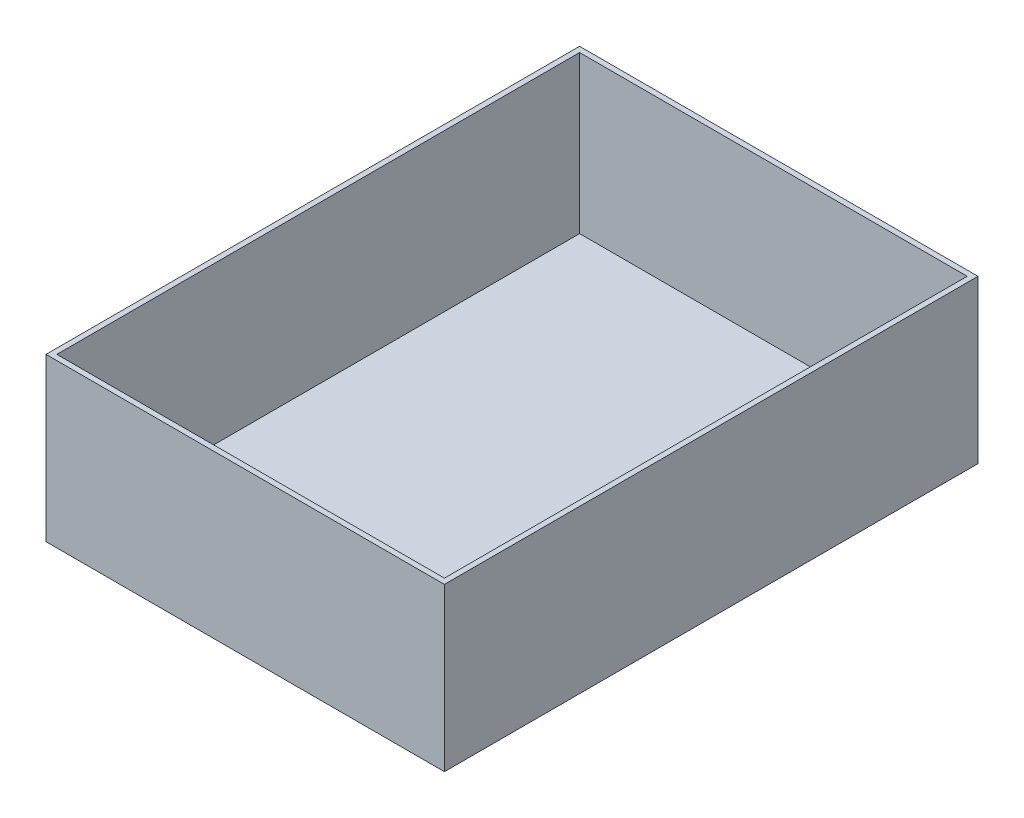
ISO-10303-21;
HEADER;
FILE_DESCRIPTION(('STEP AP214'),'2;1');
FILE_NAME('part.step','',(''),(''),'','','');
FILE_SCHEMA(('AUTOMOTIVE_DESIGN { 1 0 10303 214 1 1 1 1 }'));
ENDSEC;
DATA;
#1=APPLICATION_CONTEXT('core data for automotive mechanical design processes');
#2=APPLICATION_PROTOCOL_DEFINITION('international standard','automotive_design',2000,#1);
#3=PRODUCT_CONTEXT('',#1,'mechanical');
#4=PRODUCT('Part','Part','',(#3));
#5=PRODUCT_RELATED_PRODUCT_CATEGORY('part','',(#4));
#6=PRODUCT_DEFINITION_FORMATION('','',#4);
#7=PRODUCT_DEFINITION_CONTEXT('part definition',#1,'design');
#8=PRODUCT_DEFINITION('design','',#6,#7);
#9=PRODUCT_DEFINITION_SHAPE('','',#8);
#10=(LENGTH_UNIT() NAMED_UNIT(*) SI_UNIT(.MILLI.,.METRE.));
#11=(NAMED_UNIT(*) PLANE_ANGLE_UNIT() SI_UNIT($,.RADIAN.));
#12=(NAMED_UNIT(*) SI_UNIT($,.STERADIAN.) SOLID_ANGLE_UNIT());
#13=UNCERTAINTY_MEASURE_WITH_UNIT(LENGTH_MEASURE(1.E-05),#10,'distance_accuracy_value','');
#14=(GEOMETRIC_REPRESENTATION_CONTEXT(3) GLOBAL_UNCERTAINTY_ASSIGNED_CONTEXT((#13)) GLOBAL_UNIT_ASSIGNED_CONTEXT((#10,
#11,#12)) REPRESENTATION_CONTEXT('',''));
#15=CARTESIAN_POINT('',(0.,0.,0.));
#16=DIRECTION('',(0.,0.,1.));
#17=DIRECTION('',(1.,0.,0.));
#18=AXIS2_PLACEMENT_3D('',#15,#16,#17);
#19=CARTESIAN_POINT('',(-107.5,43.5,145.));
#20=DIRECTION('',(0.,-1.,0.));
#21=DIRECTION('',(0.,0.,-1.));
#22=AXIS2_PLACEMENT_3D('',#19,#20,#21);
#23=PLANE('',#22);
#24=DIRECTION('',(-1.,0.,0.));
#25=VECTOR('',#24,1.);
#26=CARTESIAN_POINT('',(0.,43.5,-148.));
#27=LINE('',#26,#25);
#28=CARTESIAN_POINT('',(110.5,43.5,-148.));
#29=VERTEX_POINT('',#28);
#30=CARTESIAN_POINT('',(-110.5,43.5,-148.));
#31=VERTEX_POINT('',#30);
#32=EDGE_CURVE('E107',#29,#31,#27,.T.);
#33=ORIENTED_EDGE('',*,*,#32,.T.);
#34=DIRECTION('',(0.,0.,-1.));
#35=VECTOR('',#34,1.);
#36=CARTESIAN_POINT('',(-110.5,43.5,145.));
#37=LINE('',#36,#35);
#38=CARTESIAN_POINT('',(-110.5,43.5,148.));
#39=VERTEX_POINT('',#38);
#40=EDGE_CURVE('E44',#39,#31,#37,.T.);
#41=ORIENTED_EDGE('',*,*,#40,.F.);
#42=DIRECTION('',(-1.,0.,0.));
#43=VECTOR('',#42,1.);
#44=CARTESIAN_POINT('',(0.,43.5,148.));
#45=LINE('',#44,#43);
#46=CARTESIAN_POINT('',(110.5,43.5,148.));
#47=VERTEX_POINT('',#46);
#48=EDGE_CURVE('E39',#47,#39,#45,.T.);
#49=ORIENTED_EDGE('',*,*,#48,.F.);
#50=DIRECTION('',(0.,0.,-1.));
#51=VECTOR('',#50,1.);
#52=CARTESIAN_POINT('',(110.5,43.5,145.));
#53=LINE('',#52,#51);
#54=EDGE_CURVE('E11',#47,#29,#53,.T.);
#55=ORIENTED_EDGE('',*,*,#54,.T.);
#56=EDGE_LOOP('',(#33,#41,#49,#55));
#57=FACE_BOUND('',#56,.T.);
#58=DIRECTION('',(-1.,0.,0.));
#59=VECTOR('',#58,1.);
#60=CARTESIAN_POINT('',(-107.5,43.5,-145.));
#61=LINE('',#60,#59);
#62=CARTESIAN_POINT('',(107.5,43.5,-145.));
#63=VERTEX_POINT('',#62);
#64=CARTESIAN_POINT('',(-107.5,43.5,-145.));
#65=VERTEX_POINT('',#64);
#66=EDGE_CURVE('E132',#63,#65,#61,.T.);
#67=ORIENTED_EDGE('',*,*,#66,.F.);
#68=DIRECTION('',(0.,0.,-1.));
#69=VECTOR('',#68,1.);
#70=CARTESIAN_POINT('',(107.5,43.5,145.));
#71=LINE('',#70,#69);
#72=CARTESIAN_POINT('',(107.5,43.5,145.));
#73=VERTEX_POINT('',#72);
#74=EDGE_CURVE('E108',#73,#63,#71,.T.);
#75=ORIENTED_EDGE('',*,*,#74,.F.);
#76=DIRECTION('',(-1.,0.,0.));
#77=VECTOR('',#76,1.);
#78=CARTESIAN_POINT('',(-107.5,43.5,145.));
#79=LINE('',#78,#77);
#80=CARTESIAN_POINT('',(-107.5,43.5,145.));
#81=VERTEX_POINT('',#80);
#82=EDGE_CURVE('E182',#73,#81,#79,.T.);
#83=ORIENTED_EDGE('',*,*,#82,.T.);
#84=DIRECTION('',(0.,0.,-1.));
#85=VECTOR('',#84,1.);
#86=CARTESIAN_POINT('',(-107.5,43.5,145.));
#87=LINE('',#86,#85);
#88=EDGE_CURVE('E111',#81,#65,#87,.T.);
#89=ORIENTED_EDGE('',*,*,#88,.T.);
#90=EDGE_LOOP('',(#67,#75,#83,#89));
#91=FACE_BOUND('',#90,.T.);
#92=ADVANCED_FACE('F35',(#57,#91),#23,.F.);
#93=CARTESIAN_POINT('',(110.5,-43.5,145.));
#94=DIRECTION('',(-1.,0.,0.));
#95=DIRECTION('',(0.,0.,1.));
#96=AXIS2_PLACEMENT_3D('',#93,#94,#95);
#97=PLANE('',#96);
#98=DIRECTION('',(0.,1.,0.));
#99=VECTOR('',#98,1.);
#100=CARTESIAN_POINT('',(110.5,0.,-148.));
#101=LINE('',#100,#99);
#102=CARTESIAN_POINT('',(110.5,-46.5,-148.));
#103=VERTEX_POINT('',#102);
#104=EDGE_CURVE('E105',#103,#29,#101,.T.);
#105=ORIENTED_EDGE('',*,*,#104,.T.);
#106=ORIENTED_EDGE('',*,*,#54,.F.);
#107=DIRECTION('',(0.,1.,0.));
#108=VECTOR('',#107,1.);
#109=CARTESIAN_POINT('',(110.5,0.,148.));
#110=LINE('',#109,#108);
#111=CARTESIAN_POINT('',(110.5,-46.5,148.));
#112=VERTEX_POINT('',#111);
#113=EDGE_CURVE('E98',#112,#47,#110,.T.);
#114=ORIENTED_EDGE('',*,*,#113,.F.);
#115=DIRECTION('',(0.,0.,-1.));
#116=VECTOR('',#115,1.);
#117=CARTESIAN_POINT('',(110.5,-46.5,145.));
#118=LINE('',#117,#116);
#119=EDGE_CURVE('E91',#112,#103,#118,.T.);
#120=ORIENTED_EDGE('',*,*,#119,.T.);
#121=EDGE_LOOP('',(#105,#106,#114,#120));
#122=FACE_BOUND('',#121,.T.);
#123=ADVANCED_FACE('F103',(#122),#97,.F.);
#124=CARTESIAN_POINT('',(-110.5,-43.5,145.));
#125=DIRECTION('',(1.,0.,0.));
#126=DIRECTION('',(0.,0.,-1.));
#127=AXIS2_PLACEMENT_3D('',#124,#125,#126);
#128=PLANE('',#127);
#129=DIRECTION('',(0.,-1.,0.));
#130=VECTOR('',#129,1.);
#131=CARTESIAN_POINT('',(-110.5,0.,-148.));
#132=LINE('',#131,#130);
#133=CARTESIAN_POINT('',(-110.5,-46.5,-148.));
#134=VERTEX_POINT('',#133);
#135=EDGE_CURVE('E99',#31,#134,#132,.T.);
#136=ORIENTED_EDGE('',*,*,#135,.T.);
#137=DIRECTION('',(0.,0.,-1.));
#138=VECTOR('',#137,1.);
#139=CARTESIAN_POINT('',(-110.5,-46.5,145.));
#140=LINE('',#139,#138);
#141=CARTESIAN_POINT('',(-110.5,-46.5,148.));
#142=VERTEX_POINT('',#141);
#143=EDGE_CURVE('E94',#142,#134,#140,.T.);
#144=ORIENTED_EDGE('',*,*,#143,.F.);
#145=DIRECTION('',(0.,-1.,0.));
#146=VECTOR('',#145,1.);
#147=CARTESIAN_POINT('',(-110.5,0.,148.));
#148=LINE('',#147,#146);
#149=EDGE_CURVE('E117',#39,#142,#148,.T.);
#150=ORIENTED_EDGE('',*,*,#149,.F.);
#151=ORIENTED_EDGE('',*,*,#40,.T.);
#152=EDGE_LOOP('',(#136,#144,#150,#151));
#153=FACE_BOUND('',#152,.T.);
#154=ADVANCED_FACE('F123',(#153),#128,.F.);
#155=CARTESIAN_POINT('',(-107.5,-46.5,145.));
#156=DIRECTION('',(0.,1.,0.));
#157=DIRECTION('',(0.,0.,1.));
#158=AXIS2_PLACEMENT_3D('',#155,#156,#157);
#159=PLANE('',#158);
#160=DIRECTION('',(1.,0.,0.));
#161=VECTOR('',#160,1.);
#162=CARTESIAN_POINT('',(0.,-46.5,-148.));
#163=LINE('',#162,#161);
#164=EDGE_CURVE('E88',#134,#103,#163,.T.);
#165=ORIENTED_EDGE('',*,*,#164,.T.);
#166=ORIENTED_EDGE('',*,*,#119,.F.);
#167=DIRECTION('',(1.,0.,0.));
#168=VECTOR('',#167,1.);
#169=CARTESIAN_POINT('',(0.,-46.5,148.));
#170=LINE('',#169,#168);
#171=EDGE_CURVE('E61',#142,#112,#170,.T.);
#172=ORIENTED_EDGE('',*,*,#171,.F.);
#173=ORIENTED_EDGE('',*,*,#143,.T.);
#174=EDGE_LOOP('',(#165,#166,#172,#173));
#175=FACE_BOUND('',#174,.T.);
#176=ADVANCED_FACE('F90',(#175),#159,.F.);
#177=CARTESIAN_POINT('',(0.,0.,148.));
#178=DIRECTION('',(0.,0.,-1.));
#179=DIRECTION('',(-1.,0.,0.));
#180=AXIS2_PLACEMENT_3D('',#177,#178,#179);
#181=PLANE('',#180);
#182=ORIENTED_EDGE('',*,*,#113,.T.);
#183=ORIENTED_EDGE('',*,*,#48,.T.);
#184=ORIENTED_EDGE('',*,*,#149,.T.);
#185=ORIENTED_EDGE('',*,*,#171,.T.);
#186=EDGE_LOOP('',(#182,#183,#184,#185));
#187=FACE_BOUND('',#186,.T.);
#188=ADVANCED_FACE('F204',(#187),#181,.F.);
#189=CARTESIAN_POINT('',(0.,0.,-148.));
#190=DIRECTION('',(0.,0.,-1.));
#191=DIRECTION('',(-1.,0.,0.));
#192=AXIS2_PLACEMENT_3D('',#189,#190,#191);
#193=PLANE('',#192);
#194=ORIENTED_EDGE('',*,*,#104,.F.);
#195=ORIENTED_EDGE('',*,*,#164,.F.);
#196=ORIENTED_EDGE('',*,*,#135,.F.);
#197=ORIENTED_EDGE('',*,*,#32,.F.);
#198=EDGE_LOOP('',(#194,#195,#196,#197));
#199=FACE_BOUND('',#198,.T.);
#200=ADVANCED_FACE('F37',(#199),#193,.T.);
#201=CARTESIAN_POINT('',(107.5,-43.5,145.));
#202=DIRECTION('',(-1.,0.,0.));
#203=DIRECTION('',(0.,0.,1.));
#204=AXIS2_PLACEMENT_3D('',#201,#202,#203);
#205=PLANE('',#204);
#206=DIRECTION('',(0.,1.,0.));
#207=VECTOR('',#206,1.);
#208=CARTESIAN_POINT('',(107.5,-43.5,-145.));
#209=LINE('',#208,#207);
#210=CARTESIAN_POINT('',(107.5,-43.5,-145.));
#211=VERTEX_POINT('',#210);
#212=EDGE_CURVE('E142',#211,#63,#209,.T.);
#213=ORIENTED_EDGE('',*,*,#212,.F.);
#214=DIRECTION('',(0.,0.,-1.));
#215=VECTOR('',#214,1.);
#216=CARTESIAN_POINT('',(107.5,-43.5,145.));
#217=LINE('',#216,#215);
#218=CARTESIAN_POINT('',(107.5,-43.5,145.));
#219=VERTEX_POINT('',#218);
#220=EDGE_CURVE('E151',#219,#211,#217,.T.);
#221=ORIENTED_EDGE('',*,*,#220,.F.);
#222=DIRECTION('',(0.,1.,0.));
#223=VECTOR('',#222,1.);
#224=CARTESIAN_POINT('',(107.5,-43.5,145.));
#225=LINE('',#224,#223);
#226=EDGE_CURVE('E52',#219,#73,#225,.T.);
#227=ORIENTED_EDGE('',*,*,#226,.T.);
#228=ORIENTED_EDGE('',*,*,#74,.T.);
#229=EDGE_LOOP('',(#213,#221,#227,#228));
#230=FACE_BOUND('',#229,.T.);
#231=ADVANCED_FACE('F180',(#230),#205,.T.);
#232=CARTESIAN_POINT('',(-107.5,-43.5,145.));
#233=DIRECTION('',(1.,0.,0.));
#234=DIRECTION('',(0.,0.,-1.));
#235=AXIS2_PLACEMENT_3D('',#232,#233,#234);
#236=PLANE('',#235);
#237=DIRECTION('',(0.,-1.,0.));
#238=VECTOR('',#237,1.);
#239=CARTESIAN_POINT('',(-107.5,-43.5,-145.));
#240=LINE('',#239,#238);
#241=CARTESIAN_POINT('',(-107.5,-43.5,-145.));
#242=VERTEX_POINT('',#241);
#243=EDGE_CURVE('E141',#65,#242,#240,.T.);
#244=ORIENTED_EDGE('',*,*,#243,.F.);
#245=ORIENTED_EDGE('',*,*,#88,.F.);
#246=DIRECTION('',(0.,-1.,0.));
#247=VECTOR('',#246,1.);
#248=CARTESIAN_POINT('',(-107.5,-43.5,145.));
#249=LINE('',#248,#247);
#250=CARTESIAN_POINT('',(-107.5,-43.5,145.));
#251=VERTEX_POINT('',#250);
#252=EDGE_CURVE('E165',#81,#251,#249,.T.);
#253=ORIENTED_EDGE('',*,*,#252,.T.);
#254=DIRECTION('',(0.,0.,-1.));
#255=VECTOR('',#254,1.);
#256=CARTESIAN_POINT('',(-107.5,-43.5,145.));
#257=LINE('',#256,#255);
#258=EDGE_CURVE('E154',#251,#242,#257,.T.);
#259=ORIENTED_EDGE('',*,*,#258,.T.);
#260=EDGE_LOOP('',(#244,#245,#253,#259));
#261=FACE_BOUND('',#260,.T.);
#262=ADVANCED_FACE('F162',(#261),#236,.T.);
#263=CARTESIAN_POINT('',(-107.5,-43.5,145.));
#264=DIRECTION('',(0.,1.,0.));
#265=DIRECTION('',(0.,0.,1.));
#266=AXIS2_PLACEMENT_3D('',#263,#264,#265);
#267=PLANE('',#266);
#268=DIRECTION('',(1.,0.,0.));
#269=VECTOR('',#268,1.);
#270=CARTESIAN_POINT('',(-107.5,-43.5,-145.));
#271=LINE('',#270,#269);
#272=EDGE_CURVE('E144',#242,#211,#271,.T.);
#273=ORIENTED_EDGE('',*,*,#272,.F.);
#274=ORIENTED_EDGE('',*,*,#258,.F.);
#275=DIRECTION('',(1.,0.,0.));
#276=VECTOR('',#275,1.);
#277=CARTESIAN_POINT('',(-107.5,-43.5,145.));
#278=LINE('',#277,#276);
#279=EDGE_CURVE('E155',#251,#219,#278,.T.);
#280=ORIENTED_EDGE('',*,*,#279,.T.);
#281=ORIENTED_EDGE('',*,*,#220,.T.);
#282=EDGE_LOOP('',(#273,#274,#280,#281));
#283=FACE_BOUND('',#282,.T.);
#284=ADVANCED_FACE('F171',(#283),#267,.T.);
#285=CARTESIAN_POINT('',(0.,0.,145.));
#286=DIRECTION('',(0.,0.,-1.));
#287=DIRECTION('',(-1.,0.,0.));
#288=AXIS2_PLACEMENT_3D('',#285,#286,#287);
#289=PLANE('',#288);
#290=ORIENTED_EDGE('',*,*,#226,.F.);
#291=ORIENTED_EDGE('',*,*,#279,.F.);
#292=ORIENTED_EDGE('',*,*,#252,.F.);
#293=ORIENTED_EDGE('',*,*,#82,.F.);
#294=EDGE_LOOP('',(#290,#291,#292,#293));
#295=FACE_BOUND('',#294,.T.);
#296=ADVANCED_FACE('F181',(#295),#289,.T.);
#297=CARTESIAN_POINT('',(0.,0.,-145.));
#298=DIRECTION('',(0.,0.,-1.));
#299=DIRECTION('',(-1.,0.,0.));
#300=AXIS2_PLACEMENT_3D('',#297,#298,#299);
#301=PLANE('',#300);
#302=ORIENTED_EDGE('',*,*,#212,.T.);
#303=ORIENTED_EDGE('',*,*,#66,.T.);
#304=ORIENTED_EDGE('',*,*,#243,.T.);
#305=ORIENTED_EDGE('',*,*,#272,.T.);
#306=EDGE_LOOP('',(#302,#303,#304,#305));
#307=FACE_BOUND('',#306,.T.);
#308=ADVANCED_FACE('F173',(#307),#301,.F.);
#309=CLOSED_SHELL('',(#92,#123,#154,#176,#188,#200,#231,#262,#284,#296,#308));
#310=MANIFOLD_SOLID_BREP('B2',#309);
#311=ADVANCED_BREP_SHAPE_REPRESENTATION('',(#18,#310),#14);
#312=SHAPE_DEFINITION_REPRESENTATION(#9,#311);
ENDSEC;
END-ISO-10303-21;
